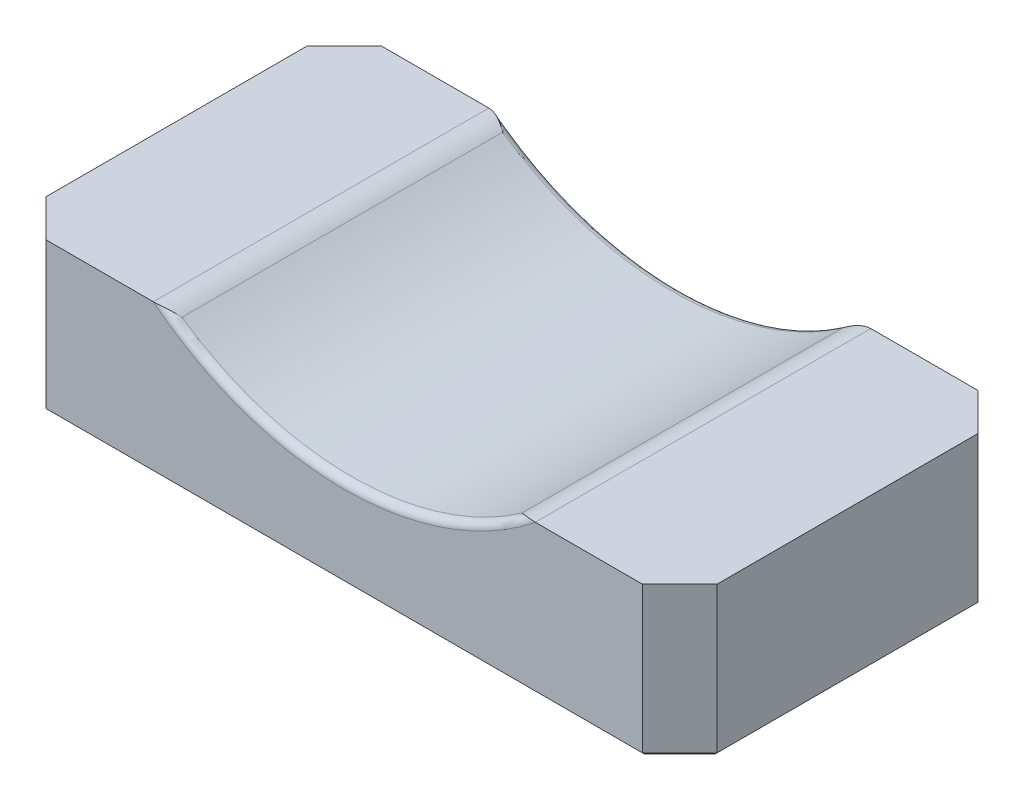
ISO-10303-21;
HEADER;
FILE_DESCRIPTION(('STEP AP214'),'2;1');
FILE_NAME('part.step','',(''),(''),'','','');
FILE_SCHEMA(('AUTOMOTIVE_DESIGN { 1 0 10303 214 1 1 1 1 }'));
ENDSEC;
DATA;
#1=APPLICATION_CONTEXT('core data for automotive mechanical design processes');
#2=APPLICATION_PROTOCOL_DEFINITION('international standard','automotive_design',2000,#1);
#3=PRODUCT_CONTEXT('',#1,'mechanical');
#4=PRODUCT('Part','Part','',(#3));
#5=PRODUCT_RELATED_PRODUCT_CATEGORY('part','',(#4));
#6=PRODUCT_DEFINITION_FORMATION('','',#4);
#7=PRODUCT_DEFINITION_CONTEXT('part definition',#1,'design');
#8=PRODUCT_DEFINITION('design','',#6,#7);
#9=PRODUCT_DEFINITION_SHAPE('','',#8);
#10=(LENGTH_UNIT() NAMED_UNIT(*) SI_UNIT(.MILLI.,.METRE.));
#11=(NAMED_UNIT(*) PLANE_ANGLE_UNIT() SI_UNIT($,.RADIAN.));
#12=(NAMED_UNIT(*) SI_UNIT($,.STERADIAN.) SOLID_ANGLE_UNIT());
#13=UNCERTAINTY_MEASURE_WITH_UNIT(LENGTH_MEASURE(1.E-05),#10,'distance_accuracy_value','');
#14=(GEOMETRIC_REPRESENTATION_CONTEXT(3) GLOBAL_UNCERTAINTY_ASSIGNED_CONTEXT((#13)) GLOBAL_UNIT_ASSIGNED_CONTEXT((#10,
#11,#12)) REPRESENTATION_CONTEXT('',''));
#15=CARTESIAN_POINT('',(0.,0.,0.));
#16=DIRECTION('',(0.,0.,1.));
#17=DIRECTION('',(1.,0.,0.));
#18=AXIS2_PLACEMENT_3D('',#15,#16,#17);
#19=CARTESIAN_POINT('',(-57.1500000000011,2.91433543964104E-13,28.575));
#20=DIRECTION('',(0.,-1.00000000000002,0.));
#21=DIRECTION('',(0.,0.,-1.));
#22=AXIS2_PLACEMENT_3D('',#19,#20,#21);
#23=PLANE('',#22);
#24=DIRECTION('',(-1.00000000000002,0.,0.));
#25=VECTOR('',#24,1.);
#26=CARTESIAN_POINT('',(-57.1500000000011,0.,-28.575));
#27=LINE('',#26,#25);
#28=CARTESIAN_POINT('',(50.800000000001,-3.12250225675825E-13,-28.575));
#29=VERTEX_POINT('',#28);
#30=CARTESIAN_POINT('',(32.5526542696603,-2.91433543964104E-13,-28.575));
#31=VERTEX_POINT('',#30);
#32=EDGE_CURVE('E323',#29,#31,#27,.T.);
#33=ORIENTED_EDGE('',*,*,#32,.T.);
#34=CARTESIAN_POINT('',(32.5526542696603,-2.91433543964104E-13,-28.575));
#35=CARTESIAN_POINT('',(32.548523685736,0.,-28.5749999965568));
#36=CARTESIAN_POINT('',(32.5443931318137,2.91433540491812E-13,-28.5749921223812));
#37=CARTESIAN_POINT('',(32.5361320839801,2.91433539836673E-13,-28.574960632565));
#38=CARTESIAN_POINT('',(32.5320015900688,0.,-28.5749370169245));
#39=CARTESIAN_POINT('',(32.5278711261594,-2.91433543964104E-13,-28.5749055305516));
#40=B_SPLINE_CURVE_WITH_KNOTS('',3,(#34,#35,#36,#37,#38,#39),.UNSPECIFIED.,.F.,.F.,(4,2,4),(0.,
0.0123916842829707,0.0247833685450492),.UNSPECIFIED.);
#41=CARTESIAN_POINT('',(32.5278711261594,-2.91433543964104E-13,-28.5749055305516));
#42=VERTEX_POINT('',#41);
#43=EDGE_CURVE('E230',#31,#42,#40,.T.);
#44=ORIENTED_EDGE('',*,*,#43,.T.);
#45=DIRECTION('',(0.,0.,1.));
#46=VECTOR('',#45,1.);
#47=CARTESIAN_POINT('',(32.5278711261594,0.,28.575));
#48=LINE('',#47,#46);
#49=CARTESIAN_POINT('',(32.5278711261594,0.,28.5749055305516));
#50=VERTEX_POINT('',#49);
#51=EDGE_CURVE('E183',#42,#50,#48,.T.);
#52=ORIENTED_EDGE('',*,*,#51,.T.);
#53=CARTESIAN_POINT('',(32.5278711261594,0.,28.5749055305516));
#54=CARTESIAN_POINT('',(32.5320015900688,1.94289026603761E-13,28.5749370169245));
#55=CARTESIAN_POINT('',(32.5361320839801,2.91433539987533E-13,28.574960632565));
#56=CARTESIAN_POINT('',(32.5443931318137,2.91433540315103E-13,28.5749921223812));
#57=CARTESIAN_POINT('',(32.548523685736,1.9428902693133E-13,28.5749999965568));
#58=CARTESIAN_POINT('',(32.5526542696603,0.,28.575));
#59=B_SPLINE_CURVE_WITH_KNOTS('',3,(#53,#54,#55,#56,#57,#58),.UNSPECIFIED.,.F.,.F.,(4,2,4),(0.,
0.0123916842620785,0.0247833685450492),.UNSPECIFIED.);
#60=CARTESIAN_POINT('',(32.5526542696603,0.,28.575));
#61=VERTEX_POINT('',#60);
#62=EDGE_CURVE('E223',#50,#61,#59,.T.);
#63=ORIENTED_EDGE('',*,*,#62,.T.);
#64=DIRECTION('',(-1.00000000000002,0.,0.));
#65=VECTOR('',#64,1.);
#66=CARTESIAN_POINT('',(-57.1500000000011,2.91433543964104E-13,28.575));
#67=LINE('',#66,#65);
#68=CARTESIAN_POINT('',(50.800000000001,0.,28.575));
#69=VERTEX_POINT('',#68);
#70=EDGE_CURVE('E196',#69,#61,#67,.T.);
#71=ORIENTED_EDGE('',*,*,#70,.F.);
#72=DIRECTION('',(0.707106781186554,0.,-0.707106781186549));
#73=VECTOR('',#72,1.);
#74=CARTESIAN_POINT('',(50.800000000001,0.,28.575));
#75=LINE('',#74,#73);
#76=CARTESIAN_POINT('',(57.1500000000011,0.,22.2249999999999));
#77=VERTEX_POINT('',#76);
#78=EDGE_CURVE('E216',#69,#77,#75,.T.);
#79=ORIENTED_EDGE('',*,*,#78,.T.);
#80=DIRECTION('',(0.,0.,-1.));
#81=VECTOR('',#80,1.);
#82=CARTESIAN_POINT('',(57.1500000000011,0.,28.575));
#83=LINE('',#82,#81);
#84=CARTESIAN_POINT('',(57.1500000000011,-2.91433543964104E-13,-22.225));
#85=VERTEX_POINT('',#84);
#86=EDGE_CURVE('E195',#77,#85,#83,.T.);
#87=ORIENTED_EDGE('',*,*,#86,.T.);
#88=DIRECTION('',(0.707106781186558,0.,0.707106781186545));
#89=VECTOR('',#88,1.);
#90=CARTESIAN_POINT('',(57.1500000000011,-2.91433543964104E-13,-22.225));
#91=LINE('',#90,#89);
#92=EDGE_CURVE('E218',#85,#29,#91,.F.);
#93=ORIENTED_EDGE('',*,*,#92,.T.);
#94=EDGE_LOOP('',(#33,#44,#52,#63,#71,#79,#87,#93));
#95=FACE_BOUND('',#94,.T.);
#96=ADVANCED_FACE('F46',(#95),#23,.F.);
#97=CARTESIAN_POINT('',(-57.1500000000011,2.91433543964104E-13,28.575));
#98=DIRECTION('',(1.00000000000002,0.,0.));
#99=DIRECTION('',(0.,0.,-1.));
#100=AXIS2_PLACEMENT_3D('',#97,#98,#99);
#101=PLANE('',#100);
#102=DIRECTION('',(0.,-1.00000000000002,0.));
#103=VECTOR('',#102,1.);
#104=CARTESIAN_POINT('',(-57.1500000000011,0.,-22.225));
#105=LINE('',#104,#103);
#106=CARTESIAN_POINT('',(-57.1500000000011,0.,-22.225));
#107=VERTEX_POINT('',#106);
#108=CARTESIAN_POINT('',(-57.150000000001,-24.8920000000002,-22.2250000000001));
#109=VERTEX_POINT('',#108);
#110=EDGE_CURVE('E182',#107,#109,#105,.T.);
#111=ORIENTED_EDGE('',*,*,#110,.T.);
#112=DIRECTION('',(0.,0.,1.));
#113=VECTOR('',#112,1.);
#114=CARTESIAN_POINT('',(-57.150000000001,-24.8920000000002,28.5749999999999));
#115=LINE('',#114,#113);
#116=CARTESIAN_POINT('',(-57.150000000001,-24.8920000000002,22.2249999999999));
#117=VERTEX_POINT('',#116);
#118=EDGE_CURVE('E13',#109,#117,#115,.T.);
#119=ORIENTED_EDGE('',*,*,#118,.T.);
#120=DIRECTION('',(0.,1.00000000000002,0.));
#121=VECTOR('',#120,1.);
#122=CARTESIAN_POINT('',(-57.1500000000011,2.91433543964104E-13,22.2249999999999));
#123=LINE('',#122,#121);
#124=CARTESIAN_POINT('',(-57.1500000000011,2.91433543964104E-13,22.2249999999999));
#125=VERTEX_POINT('',#124);
#126=EDGE_CURVE('E173',#117,#125,#123,.T.);
#127=ORIENTED_EDGE('',*,*,#126,.T.);
#128=DIRECTION('',(0.,0.,-1.));
#129=VECTOR('',#128,1.);
#130=CARTESIAN_POINT('',(-57.1500000000011,2.91433543964104E-13,28.575));
#131=LINE('',#130,#129);
#132=EDGE_CURVE('E176',#125,#107,#131,.T.);
#133=ORIENTED_EDGE('',*,*,#132,.T.);
#134=EDGE_LOOP('',(#111,#119,#127,#133));
#135=FACE_BOUND('',#134,.T.);
#136=ADVANCED_FACE('F175',(#135),#101,.F.);
#137=CARTESIAN_POINT('',(-57.150000000001,-25.4000000000002,28.5749999999999));
#138=DIRECTION('',(0.,1.00000000000002,0.));
#139=DIRECTION('',(-1.00000000000002,0.,0.));
#140=AXIS2_PLACEMENT_3D('',#137,#138,#139);
#141=PLANE('',#140);
#142=CARTESIAN_POINT('',(31.75,-25.4000000000002,0.));
#143=DIRECTION('',(0.,-1.,0.));
#144=DIRECTION('',(1.,0.,0.));
#145=AXIS2_PLACEMENT_3D('',#142,#143,#144);
#146=CIRCLE('',#145,7.112);
#147=CARTESIAN_POINT('',(38.862,-25.4000000000002,0.));
#148=VERTEX_POINT('',#147);
#149=EDGE_CURVE('E469',#148,#148,#146,.T.);
#150=ORIENTED_EDGE('',*,*,#149,.F.);
#151=EDGE_LOOP('',(#150));
#152=FACE_BOUND('',#151,.T.);
#153=CARTESIAN_POINT('',(-31.75,-25.4000000000002,0.));
#154=DIRECTION('',(0.,-1.,0.));
#155=DIRECTION('',(1.,0.,0.));
#156=AXIS2_PLACEMENT_3D('',#153,#154,#155);
#157=CIRCLE('',#156,7.112);
#158=CARTESIAN_POINT('',(-24.638,-25.4000000000002,0.));
#159=VERTEX_POINT('',#158);
#160=EDGE_CURVE('E472',#159,#159,#157,.T.);
#161=ORIENTED_EDGE('',*,*,#160,.F.);
#162=EDGE_LOOP('',(#161));
#163=FACE_BOUND('',#162,.T.);
#164=DIRECTION('',(-1.00000000000002,0.,0.));
#165=VECTOR('',#164,1.);
#166=CARTESIAN_POINT('',(-50.800000000001,-25.4000000000003,28.0669999999998));
#167=LINE('',#166,#165);
#168=CARTESIAN_POINT('',(50.5895795103156,-25.4000000000003,28.0669999999998));
#169=VERTEX_POINT('',#168);
#170=CARTESIAN_POINT('',(-50.5895795103154,-25.4000000000003,28.0669999999998));
#171=VERTEX_POINT('',#170);
#172=EDGE_CURVE('E404',#169,#171,#167,.T.);
#173=ORIENTED_EDGE('',*,*,#172,.T.);
#174=DIRECTION('',(-0.707106781186554,0.,-0.707106781186549));
#175=VECTOR('',#174,1.);
#176=CARTESIAN_POINT('',(-56.7907897551582,-25.4000000000002,21.865789755157));
#177=LINE('',#176,#175);
#178=CARTESIAN_POINT('',(-56.642000000001,-25.4000000000002,22.0145795103143));
#179=VERTEX_POINT('',#178);
#180=EDGE_CURVE('E401',#171,#179,#177,.T.);
#181=ORIENTED_EDGE('',*,*,#180,.T.);
#182=DIRECTION('',(0.,0.,-1.));
#183=VECTOR('',#182,1.);
#184=CARTESIAN_POINT('',(-56.642000000001,-25.4000000000002,28.5749999999999));
#185=LINE('',#184,#183);
#186=CARTESIAN_POINT('',(-56.642000000001,-25.4000000000002,-22.0145795103146));
#187=VERTEX_POINT('',#186);
#188=EDGE_CURVE('E412',#179,#187,#185,.T.);
#189=ORIENTED_EDGE('',*,*,#188,.T.);
#190=DIRECTION('',(0.707106781186558,0.,-0.707106781186545));
#191=VECTOR('',#190,1.);
#192=CARTESIAN_POINT('',(-50.4407897551582,-25.4000000000003,-28.2157897551574));
#193=LINE('',#192,#191);
#194=CARTESIAN_POINT('',(-50.5895795103154,-25.4000000000003,-28.0670000000001));
#195=VERTEX_POINT('',#194);
#196=EDGE_CURVE('E411',#187,#195,#193,.T.);
#197=ORIENTED_EDGE('',*,*,#196,.T.);
#198=DIRECTION('',(1.00000000000002,0.,0.));
#199=VECTOR('',#198,1.);
#200=CARTESIAN_POINT('',(-57.150000000001,-25.4000000000002,-28.0670000000001));
#201=LINE('',#200,#199);
#202=CARTESIAN_POINT('',(50.5895795103156,-25.4000000000004,-28.0670000000001));
#203=VERTEX_POINT('',#202);
#204=EDGE_CURVE('E409',#195,#203,#201,.T.);
#205=ORIENTED_EDGE('',*,*,#204,.T.);
#206=DIRECTION('',(0.707106781186558,0.,0.707106781186545));
#207=VECTOR('',#206,1.);
#208=CARTESIAN_POINT('',(56.7907897551584,-25.4000000000005,-21.8657897551574));
#209=LINE('',#208,#207);
#210=CARTESIAN_POINT('',(56.6420000000011,-25.4000000000005,-22.0145795103146));
#211=VERTEX_POINT('',#210);
#212=EDGE_CURVE('E354',#203,#211,#209,.T.);
#213=ORIENTED_EDGE('',*,*,#212,.T.);
#214=DIRECTION('',(0.,0.,1.));
#215=VECTOR('',#214,1.);
#216=CARTESIAN_POINT('',(56.6420000000011,-25.4000000000005,28.5749999999999));
#217=LINE('',#216,#215);
#218=CARTESIAN_POINT('',(56.6420000000011,-25.4000000000005,22.0145795103143));
#219=VERTEX_POINT('',#218);
#220=EDGE_CURVE('E393',#211,#219,#217,.T.);
#221=ORIENTED_EDGE('',*,*,#220,.T.);
#222=DIRECTION('',(-0.707106781186554,0.,0.707106781186549));
#223=VECTOR('',#222,1.);
#224=CARTESIAN_POINT('',(50.4407897551583,-25.4000000000003,28.2157897551571));
#225=LINE('',#224,#223);
#226=EDGE_CURVE('E388',#219,#169,#225,.T.);
#227=ORIENTED_EDGE('',*,*,#226,.T.);
#228=EDGE_LOOP('',(#173,#181,#189,#197,#205,#213,#221,#227));
#229=FACE_BOUND('',#228,.T.);
#230=ADVANCED_FACE('F320',(#152,#163,#229),#141,.F.);
#231=CARTESIAN_POINT('',(57.1500000000011,0.,28.575));
#232=DIRECTION('',(-1.00000000000002,0.,0.));
#233=DIRECTION('',(0.,0.,1.));
#234=AXIS2_PLACEMENT_3D('',#231,#232,#233);
#235=PLANE('',#234);
#236=DIRECTION('',(0.,-1.00000000000002,0.));
#237=VECTOR('',#236,1.);
#238=CARTESIAN_POINT('',(57.1500000000011,-25.4000000000005,22.2249999999998));
#239=LINE('',#238,#237);
#240=CARTESIAN_POINT('',(57.1500000000011,-24.8920000000005,22.2249999999998));
#241=VERTEX_POINT('',#240);
#242=EDGE_CURVE('E211',#77,#241,#239,.T.);
#243=ORIENTED_EDGE('',*,*,#242,.T.);
#244=DIRECTION('',(0.,0.,-1.));
#245=VECTOR('',#244,1.);
#246=CARTESIAN_POINT('',(57.1500000000011,-24.8920000000005,28.5749999999999));
#247=LINE('',#246,#245);
#248=CARTESIAN_POINT('',(57.1500000000011,-24.8920000000005,-22.2250000000001));
#249=VERTEX_POINT('',#248);
#250=EDGE_CURVE('E364',#241,#249,#247,.T.);
#251=ORIENTED_EDGE('',*,*,#250,.T.);
#252=DIRECTION('',(0.,1.00000000000002,0.));
#253=VECTOR('',#252,1.);
#254=CARTESIAN_POINT('',(57.1500000000011,-2.91433543964104E-13,-22.225));
#255=LINE('',#254,#253);
#256=EDGE_CURVE('E214',#249,#85,#255,.T.);
#257=ORIENTED_EDGE('',*,*,#256,.T.);
#258=ORIENTED_EDGE('',*,*,#86,.F.);
#259=EDGE_LOOP('',(#243,#251,#257,#258));
#260=FACE_BOUND('',#259,.T.);
#261=ADVANCED_FACE('F244',(#260),#235,.F.);
#262=DIRECTION('',(0.,0.,1.));
#263=VECTOR('',#262,1.);
#264=CARTESIAN_POINT('',(-32.5278711261594,2.91433543964104E-13,28.575));
#265=LINE('',#264,#263);
#266=CARTESIAN_POINT('',(-32.5278711261594,2.91433543964104E-13,28.5749055305516));
#267=VERTEX_POINT('',#266);
#268=CARTESIAN_POINT('',(-32.5278711261594,0.,-28.5749055305516));
#269=VERTEX_POINT('',#268);
#270=EDGE_CURVE('E342',#267,#269,#265,.F.);
#271=ORIENTED_EDGE('',*,*,#270,.T.);
#272=CARTESIAN_POINT('',(-32.5278711261594,0.,-28.5749055305516));
#273=CARTESIAN_POINT('',(-32.5320015900688,1.94289026612377E-13,-28.5749370169245));
#274=CARTESIAN_POINT('',(-32.5361320839801,2.91433540000458E-13,-28.574960632565));
#275=CARTESIAN_POINT('',(-32.5443931318137,2.91433540328027E-13,-28.5749921223812));
#276=CARTESIAN_POINT('',(-32.548523685736,1.94289026939946E-13,-28.5749999965568));
#277=CARTESIAN_POINT('',(-32.5526542696603,0.,-28.575));
#278=B_SPLINE_CURVE_WITH_KNOTS('',3,(#272,#273,#274,#275,#276,#277),.UNSPECIFIED.,.F.,.F.,(4,2,
4),(0.,0.0123916842620785,0.0247833685450492),.UNSPECIFIED.);
#279=CARTESIAN_POINT('',(-32.5526542696603,0.,-28.575));
#280=VERTEX_POINT('',#279);
#281=EDGE_CURVE('E258',#269,#280,#278,.T.);
#282=ORIENTED_EDGE('',*,*,#281,.T.);
#283=CARTESIAN_POINT('',(-50.800000000001,0.,-28.575));
#284=VERTEX_POINT('',#283);
#285=EDGE_CURVE('E330',#280,#284,#27,.T.);
#286=ORIENTED_EDGE('',*,*,#285,.T.);
#287=DIRECTION('',(0.707106781186558,0.,-0.707106781186545));
#288=VECTOR('',#287,1.);
#289=CARTESIAN_POINT('',(-57.1500000000011,0.,-22.225));
#290=LINE('',#289,#288);
#291=EDGE_CURVE('E194',#284,#107,#290,.F.);
#292=ORIENTED_EDGE('',*,*,#291,.T.);
#293=ORIENTED_EDGE('',*,*,#132,.F.);
#294=DIRECTION('',(0.707106781186554,0.,0.707106781186549));
#295=VECTOR('',#294,1.);
#296=CARTESIAN_POINT('',(-50.800000000001,3.12250225675825E-13,28.575));
#297=LINE('',#296,#295);
#298=CARTESIAN_POINT('',(-50.800000000001,3.12250225675825E-13,28.575));
#299=VERTEX_POINT('',#298);
#300=EDGE_CURVE('E190',#125,#299,#297,.T.);
#301=ORIENTED_EDGE('',*,*,#300,.T.);
#302=CARTESIAN_POINT('',(-32.5526542696603,2.91433543964104E-13,28.575));
#303=VERTEX_POINT('',#302);
#304=EDGE_CURVE('E329',#303,#299,#67,.T.);
#305=ORIENTED_EDGE('',*,*,#304,.F.);
#306=CARTESIAN_POINT('',(-32.5526542696603,2.91433543964104E-13,28.575));
#307=CARTESIAN_POINT('',(-32.548523685736,2.91433541439479E-13,28.5749999965568));
#308=CARTESIAN_POINT('',(-32.5443931318137,2.91433540177167E-13,28.5749921223812));
#309=CARTESIAN_POINT('',(-32.5361320839801,2.91433540177167E-13,28.574960632565));
#310=CARTESIAN_POINT('',(-32.5320015900688,2.91433541439479E-13,28.5749370169245));
#311=CARTESIAN_POINT('',(-32.5278711261594,2.91433543964104E-13,28.5749055305516));
#312=B_SPLINE_CURVE_WITH_KNOTS('',3,(#306,#307,#308,#309,#310,#311),.UNSPECIFIED.,.F.,.F.,(4,2,
4),(0.,0.0123916842829707,0.0247833685450492),.UNSPECIFIED.);
#313=EDGE_CURVE('E253',#303,#267,#312,.T.);
#314=ORIENTED_EDGE('',*,*,#313,.T.);
#315=EDGE_LOOP('',(#271,#282,#286,#292,#293,#301,#305,#314));
#316=FACE_BOUND('',#315,.T.);
#317=ADVANCED_FACE('F188',(#316),#23,.F.);
#318=CARTESIAN_POINT('',(-57.1500000000011,2.91433543964104E-13,28.575));
#319=DIRECTION('',(0.,0.,1.));
#320=DIRECTION('',(1.00000000000002,0.,0.));
#321=AXIS2_PLACEMENT_3D('',#318,#319,#320);
#322=PLANE('',#321);
#323=DIRECTION('',(0.,-1.00000000000002,0.));
#324=VECTOR('',#323,1.);
#325=CARTESIAN_POINT('',(-50.800000000001,-25.4000000000003,28.5749999999999));
#326=LINE('',#325,#324);
#327=CARTESIAN_POINT('',(-50.800000000001,-24.8920000000003,28.5749999999999));
#328=VERTEX_POINT('',#327);
#329=EDGE_CURVE('E200',#299,#328,#326,.T.);
#330=ORIENTED_EDGE('',*,*,#329,.T.);
#331=DIRECTION('',(1.00000000000002,0.,0.));
#332=VECTOR('',#331,1.);
#333=CARTESIAN_POINT('',(50.8000000000011,-24.8920000000002,28.5749999999999));
#334=LINE('',#333,#332);
#335=CARTESIAN_POINT('',(50.8000000000011,-24.8920000000002,28.5749999999999));
#336=VERTEX_POINT('',#335);
#337=EDGE_CURVE('E395',#328,#336,#334,.T.);
#338=ORIENTED_EDGE('',*,*,#337,.T.);
#339=DIRECTION('',(0.,1.00000000000002,0.));
#340=VECTOR('',#339,1.);
#341=CARTESIAN_POINT('',(50.800000000001,0.,28.575));
#342=LINE('',#341,#340);
#343=EDGE_CURVE('E203',#336,#69,#342,.T.);
#344=ORIENTED_EDGE('',*,*,#343,.T.);
#345=ORIENTED_EDGE('',*,*,#70,.T.);
#346=CARTESIAN_POINT('',(0.,40.6400000000007,28.575));
#347=DIRECTION('',(0.,0.,1.));
#348=DIRECTION('',(1.00000000000002,0.,0.));
#349=AXIS2_PLACEMENT_3D('',#346,#347,#348);
#350=CIRCLE('',#349,52.07);
#351=EDGE_CURVE('E269',#61,#303,#350,.F.);
#352=ORIENTED_EDGE('',*,*,#351,.T.);
#353=ORIENTED_EDGE('',*,*,#304,.T.);
#354=EDGE_LOOP('',(#330,#338,#344,#345,#352,#353));
#355=FACE_BOUND('',#354,.T.);
#356=ADVANCED_FACE('F243',(#355),#322,.T.);
#357=CARTESIAN_POINT('',(-57.1500000000011,0.,-28.575));
#358=DIRECTION('',(0.,0.,1.));
#359=DIRECTION('',(1.00000000000002,0.,0.));
#360=AXIS2_PLACEMENT_3D('',#357,#358,#359);
#361=PLANE('',#360);
#362=DIRECTION('',(0.,-1.00000000000002,0.));
#363=VECTOR('',#362,1.);
#364=CARTESIAN_POINT('',(50.800000000001,-3.12250225675825E-13,-28.575));
#365=LINE('',#364,#363);
#366=CARTESIAN_POINT('',(50.8000000000011,-24.8920000000004,-28.5750000000001));
#367=VERTEX_POINT('',#366);
#368=EDGE_CURVE('E205',#29,#367,#365,.T.);
#369=ORIENTED_EDGE('',*,*,#368,.T.);
#370=DIRECTION('',(-1.00000000000002,0.,0.));
#371=VECTOR('',#370,1.);
#372=CARTESIAN_POINT('',(-57.150000000001,-24.8920000000002,-28.5750000000001));
#373=LINE('',#372,#371);
#374=CARTESIAN_POINT('',(-50.800000000001,-24.8920000000003,-28.5750000000001));
#375=VERTEX_POINT('',#374);
#376=EDGE_CURVE('E70',#367,#375,#373,.T.);
#377=ORIENTED_EDGE('',*,*,#376,.T.);
#378=DIRECTION('',(0.,1.00000000000002,0.));
#379=VECTOR('',#378,1.);
#380=CARTESIAN_POINT('',(-50.800000000001,0.,-28.575));
#381=LINE('',#380,#379);
#382=EDGE_CURVE('E201',#375,#284,#381,.T.);
#383=ORIENTED_EDGE('',*,*,#382,.T.);
#384=ORIENTED_EDGE('',*,*,#285,.F.);
#385=CARTESIAN_POINT('',(0.,40.6400000000006,-28.575));
#386=DIRECTION('',(0.,0.,1.));
#387=DIRECTION('',(1.00000000000002,0.,0.));
#388=AXIS2_PLACEMENT_3D('',#385,#386,#387);
#389=CIRCLE('',#388,52.07);
#390=EDGE_CURVE('E220',#280,#31,#389,.T.);
#391=ORIENTED_EDGE('',*,*,#390,.T.);
#392=ORIENTED_EDGE('',*,*,#32,.F.);
#393=EDGE_LOOP('',(#369,#377,#383,#384,#391,#392));
#394=FACE_BOUND('',#393,.T.);
#395=ADVANCED_FACE('F245',(#394),#361,.F.);
#396=CARTESIAN_POINT('',(0.,40.6400000000006,-28.575));
#397=DIRECTION('',(0.,0.,1.));
#398=DIRECTION('',(1.00000000000002,0.,0.));
#399=AXIS2_PLACEMENT_3D('',#396,#397,#398);
#400=CYLINDRICAL_SURFACE('',#399,50.8);
#401=DIRECTION('',(0.,0.,1.));
#402=VECTOR('',#401,1.);
#403=CARTESIAN_POINT('',(28.9136632232529,-1.12888888888918,-28.575));
#404=LINE('',#403,#402);
#405=CARTESIAN_POINT('',(28.9136632232529,-1.12888888888889,27.305));
#406=VERTEX_POINT('',#405);
#407=CARTESIAN_POINT('',(28.9136632232529,-1.12888888888915,-27.305));
#408=VERTEX_POINT('',#407);
#409=EDGE_CURVE('E336',#406,#408,#404,.F.);
#410=ORIENTED_EDGE('',*,*,#409,.T.);
#411=CARTESIAN_POINT('',(0.,40.6400000000006,-27.305));
#412=DIRECTION('',(0.,0.,1.));
#413=DIRECTION('',(1.00000000000002,0.,0.));
#414=AXIS2_PLACEMENT_3D('',#411,#412,#413);
#415=CIRCLE('',#414,50.8);
#416=CARTESIAN_POINT('',(-28.9136632232529,-1.12888888888892,-27.305));
#417=VERTEX_POINT('',#416);
#418=EDGE_CURVE('E430',#408,#417,#415,.F.);
#419=ORIENTED_EDGE('',*,*,#418,.T.);
#420=DIRECTION('',(0.,0.,1.));
#421=VECTOR('',#420,1.);
#422=CARTESIAN_POINT('',(-28.9136632232529,-1.12888888888892,-28.575));
#423=LINE('',#422,#421);
#424=CARTESIAN_POINT('',(-28.9136632232529,-1.12888888888864,27.305));
#425=VERTEX_POINT('',#424);
#426=EDGE_CURVE('E339',#417,#425,#423,.T.);
#427=ORIENTED_EDGE('',*,*,#426,.T.);
#428=CARTESIAN_POINT('',(0.,40.6400000000007,27.305));
#429=DIRECTION('',(0.,0.,1.));
#430=DIRECTION('',(1.00000000000002,0.,0.));
#431=AXIS2_PLACEMENT_3D('',#428,#429,#430);
#432=CIRCLE('',#431,50.8);
#433=EDGE_CURVE('E288',#425,#406,#432,.T.);
#434=ORIENTED_EDGE('',*,*,#433,.T.);
#435=EDGE_LOOP('',(#410,#419,#427,#434));
#436=FACE_BOUND('',#435,.T.);
#437=ADVANCED_FACE('F437',(#436),#400,.F.);
#438=CARTESIAN_POINT('',(-32.5278711261594,-6.35000000000004,-28.5750000000001));
#439=DIRECTION('',(0.,0.,1.));
#440=DIRECTION('',(1.00000000000002,0.,0.));
#441=AXIS2_PLACEMENT_3D('',#438,#439,#440);
#442=CYLINDRICAL_SURFACE('',#441,6.35);
#443=ORIENTED_EDGE('',*,*,#426,.F.);
#444=CARTESIAN_POINT('',(-32.5278711261594,0.,-28.5749055305516));
#445=CARTESIAN_POINT('',(-32.4326052727065,1.23361700358794E-05,-28.5741375717471));
#446=CARTESIAN_POINT('',(-32.3374751653546,-0.00214318057374986,-28.5692935018116));
#447=CARTESIAN_POINT('',(-32.1481863465688,-0.010658225621164,-28.5526880681244));
#448=CARTESIAN_POINT('',(-32.05402607832,-0.0170093761233202,-28.5409404943753));
#449=CARTESIAN_POINT('',(-31.867685648764,-0.0337228581218755,-28.5118582370422));
#450=CARTESIAN_POINT('',(-31.7754959899061,-0.0440551522599837,-28.494565550953));
#451=CARTESIAN_POINT('',(-31.592595040929,-0.0685768401766249,-28.4552816794636));
#452=CARTESIAN_POINT('',(-31.5018847960354,-0.0827688455498842,-28.4332873149329));
#453=CARTESIAN_POINT('',(-31.2608537419123,-0.1257936947056,-28.369059066685));
#454=CARTESIAN_POINT('',(-31.1120787258601,-0.158009908817166,-28.3232532601377));
#455=CARTESIAN_POINT('',(-30.8197732187223,-0.232184675674215,-28.2235452546097));
#456=CARTESIAN_POINT('',(-30.6762452470046,-0.274147839116602,-28.1696392281752));
#457=CARTESIAN_POINT('',(-30.3940195381641,-0.367412389415487,-28.0557135437908));
#458=CARTESIAN_POINT('',(-30.2553445790987,-0.418752195886097,-27.9956691977282));
#459=CARTESIAN_POINT('',(-29.9835493734577,-0.53016391967048,-27.8714593233469));
#460=CARTESIAN_POINT('',(-29.8504272272185,-0.590232818626511,-27.8072952238256));
#461=CARTESIAN_POINT('',(-29.5811370801932,-0.722989158594967,-27.6720050165354));
#462=CARTESIAN_POINT('',(-29.4453414065977,-0.796245635373238,-27.600698247917));
#463=CARTESIAN_POINT('',(-29.1802544079629,-0.951895303067302,-27.4567385806822));
#464=CARTESIAN_POINT('',(-29.0509507544523,-1.03427014416024,-27.3840886221064));
#465=CARTESIAN_POINT('',(-28.9211076224025,-1.12374154264016,-27.3092930985073));
#466=CARTESIAN_POINT('',(-28.9173840306975,-1.12631324014462,-27.3071465392448));
#467=CARTESIAN_POINT('',(-28.9136632232529,-1.12888888888891,-27.305));
#468=B_SPLINE_CURVE_WITH_KNOTS('',3,(#444,#445,#446,#447,#448,#449,#450,#451,#452,#453,#454,
#455,#456,#457,#458,#459,#460,#461,#462,#463,#464,#465,#466,#467),.UNSPECIFIED.,.F.,.F.,(4,2,2,
2,2,2,2,2,2,2,2,4),(0.,0.285546239702894,0.570524019894234,0.853392490385611,1.1364528362895,
1.61259867700446,2.08897021411319,2.56733929413345,3.04554335489289,3.55509314032492,
4.06363553426623,4.07866144483396),.UNSPECIFIED.);
#469=EDGE_CURVE('E259',#417,#269,#468,.F.);
#470=ORIENTED_EDGE('',*,*,#469,.T.);
#471=ORIENTED_EDGE('',*,*,#270,.F.);
#472=CARTESIAN_POINT('',(-32.5278711261594,2.91433543964104E-13,28.5749055305516));
#473=CARTESIAN_POINT('',(-32.4326052727065,1.23361701199683E-05,28.5741375717471));
#474=CARTESIAN_POINT('',(-32.3374751653546,-0.0021431805737323,28.5692935018116));
#475=CARTESIAN_POINT('',(-32.1481863465689,-0.0106582256211819,28.5526880681244));
#476=CARTESIAN_POINT('',(-32.0540260783201,-0.0170093761233074,28.5409404943753));
#477=CARTESIAN_POINT('',(-31.867685648764,-0.0337228581218869,28.5118582370423));
#478=CARTESIAN_POINT('',(-31.7754959899061,-0.0440551522600492,28.494565550953));
#479=CARTESIAN_POINT('',(-31.592595040929,-0.0685768401765563,28.4552816794636));
#480=CARTESIAN_POINT('',(-31.5018847960354,-0.0827688455496268,28.4332873149329));
#481=CARTESIAN_POINT('',(-31.2608537419123,-0.125793694705196,28.369059066685));
#482=CARTESIAN_POINT('',(-31.1120787258602,-0.15800990881705,28.3232532601378));
#483=CARTESIAN_POINT('',(-30.8197732187224,-0.232184675674295,28.2235452546098));
#484=CARTESIAN_POINT('',(-30.6762452470047,-0.274147839116589,28.1696392281753));
#485=CARTESIAN_POINT('',(-30.3940195381641,-0.367412389415461,28.055713543791));
#486=CARTESIAN_POINT('',(-30.2553445790987,-0.418752195886152,27.9956691977284));
#487=CARTESIAN_POINT('',(-29.9835493734578,-0.530163919670393,27.871459323347));
#488=CARTESIAN_POINT('',(-29.8504272272185,-0.5902328186262,27.8072952238256));
#489=CARTESIAN_POINT('',(-29.5811370801932,-0.722989158594713,27.6720050165355));
#490=CARTESIAN_POINT('',(-29.4453414065977,-0.7962456353733,27.6006982479175));
#491=CARTESIAN_POINT('',(-29.1802544079628,-0.951895303067299,27.4567385806826));
#492=CARTESIAN_POINT('',(-29.0509507544522,-1.03427014415985,27.3840886221064));
#493=CARTESIAN_POINT('',(-28.9211076224025,-1.12374154263988,27.3092930985073));
#494=CARTESIAN_POINT('',(-28.9173840306975,-1.12631324014434,27.3071465392448));
#495=CARTESIAN_POINT('',(-28.9136632232529,-1.12888888888864,27.305));
#496=B_SPLINE_CURVE_WITH_KNOTS('',3,(#472,#473,#474,#475,#476,#477,#478,#479,#480,#481,#482,
#483,#484,#485,#486,#487,#488,#489,#490,#491,#492,#493,#494,#495),.UNSPECIFIED.,.F.,.F.,(4,2,2,
2,2,2,2,2,2,2,2,4),(0.,0.285546239702886,0.570524019894232,0.853392490385607,1.13645283628947,
1.61259867700439,2.08897021411312,2.56733929413339,3.04554335489281,3.55509314032486,
4.06363553426615,4.07866144483388),.UNSPECIFIED.);
#497=EDGE_CURVE('E426',#267,#425,#496,.T.);
#498=ORIENTED_EDGE('',*,*,#497,.T.);
#499=EDGE_LOOP('',(#443,#470,#471,#498));
#500=FACE_BOUND('',#499,.T.);
#501=ADVANCED_FACE('F299',(#500),#442,.T.);
#502=CARTESIAN_POINT('',(32.5278711261594,-6.3500000000003,-28.5750000000001));
#503=DIRECTION('',(0.,0.,1.));
#504=DIRECTION('',(1.00000000000002,0.,0.));
#505=AXIS2_PLACEMENT_3D('',#502,#503,#504);
#506=CYLINDRICAL_SURFACE('',#505,6.35);
#507=ORIENTED_EDGE('',*,*,#51,.F.);
#508=CARTESIAN_POINT('',(32.5278711261594,-2.91433543964104E-13,-28.5749055305516));
#509=CARTESIAN_POINT('',(32.4326052727065,1.23361697618115E-05,-28.5741375717471));
#510=CARTESIAN_POINT('',(32.3374751653546,-0.00214318057401681,-28.5692935018116));
#511=CARTESIAN_POINT('',(32.1481863465688,-0.0106582256214265,-28.5526880681245));
#512=CARTESIAN_POINT('',(32.05402607832,-0.0170093761235851,-28.5409404943753));
#513=CARTESIAN_POINT('',(31.867685648764,-0.0337228581221439,-28.5118582370423));
#514=CARTESIAN_POINT('',(31.7754959899061,-0.0440551522602531,-28.4945655509531));
#515=CARTESIAN_POINT('',(31.592595040929,-0.0685768401768891,-28.4552816794637));
#516=CARTESIAN_POINT('',(31.5018847960354,-0.0827688455501421,-28.4332873149329));
#517=CARTESIAN_POINT('',(31.2608537419122,-0.125793694705856,-28.369059066685));
#518=CARTESIAN_POINT('',(31.1120787258601,-0.158009908817437,-28.3232532601379));
#519=CARTESIAN_POINT('',(30.8197732187223,-0.232184675674495,-28.2235452546099));
#520=CARTESIAN_POINT('',(30.6762452470045,-0.274147839116875,-28.1696392281753));
#521=CARTESIAN_POINT('',(30.394019538164,-0.367412389415785,-28.0557135437911));
#522=CARTESIAN_POINT('',(30.2553445790985,-0.418752195886426,-27.9956691977286));
#523=CARTESIAN_POINT('',(29.9835493734577,-0.530163919670765,-27.8714593233471));
#524=CARTESIAN_POINT('',(29.8504272272185,-0.590232818626721,-27.8072952238254));
#525=CARTESIAN_POINT('',(29.5811370801931,-0.722989158595298,-27.6720050165356));
#526=CARTESIAN_POINT('',(29.4453414065974,-0.796245635373782,-27.600698247918));
#527=CARTESIAN_POINT('',(29.1802544079625,-0.951895303067745,-27.4567385806832));
#528=CARTESIAN_POINT('',(29.0509507544522,-1.03427014416037,-27.3840886221064));
#529=CARTESIAN_POINT('',(28.9211076224025,-1.12374154264039,-27.3092930985073));
#530=CARTESIAN_POINT('',(28.9173840306975,-1.12631324014486,-27.3071465392448));
#531=CARTESIAN_POINT('',(28.9136632232529,-1.12888888888915,-27.305));
#532=B_SPLINE_CURVE_WITH_KNOTS('',3,(#508,#509,#510,#511,#512,#513,#514,#515,#516,#517,#518,
#519,#520,#521,#522,#523,#524,#525,#526,#527,#528,#529,#530,#531),.UNSPECIFIED.,.F.,.F.,(4,2,2,
2,2,2,2,2,2,2,2,4),(0.,0.285546239702913,0.570524019894257,0.853392490385629,1.13645283628951,
1.61259867700448,2.08897021411319,2.56733929413345,3.04554335489293,3.55509314032497,
4.06363553426626,4.078661444834),.UNSPECIFIED.);
#533=EDGE_CURVE('E282',#42,#408,#532,.T.);
#534=ORIENTED_EDGE('',*,*,#533,.T.);
#535=ORIENTED_EDGE('',*,*,#409,.F.);
#536=CARTESIAN_POINT('',(32.5278711261594,0.,28.5749055305516));
#537=CARTESIAN_POINT('',(32.4326052727065,1.23361698464971E-05,28.5741375717471));
#538=CARTESIAN_POINT('',(32.3374751653546,-0.00214318057399851,28.5692935018116));
#539=CARTESIAN_POINT('',(32.1481863465688,-0.0106582256214435,28.5526880681245));
#540=CARTESIAN_POINT('',(32.05402607832,-0.0170093761235713,28.5409404943753));
#541=CARTESIAN_POINT('',(31.867685648764,-0.0337228581221536,28.5118582370423));
#542=CARTESIAN_POINT('',(31.7754959899061,-0.0440551522603163,28.4945655509531));
#543=CARTESIAN_POINT('',(31.592595040929,-0.0685768401768184,28.4552816794637));
#544=CARTESIAN_POINT('',(31.5018847960354,-0.0827688455498835,28.4332873149329));
#545=CARTESIAN_POINT('',(31.2608537419122,-0.125793694705454,28.369059066685));
#546=CARTESIAN_POINT('',(31.1120787258601,-0.158009908817324,28.3232532601379));
#547=CARTESIAN_POINT('',(30.8197732187223,-0.232184675674579,28.22354525461));
#548=CARTESIAN_POINT('',(30.6762452470046,-0.274147839116866,28.1696392281754));
#549=CARTESIAN_POINT('',(30.394019538164,-0.367412389415762,28.0557135437913));
#550=CARTESIAN_POINT('',(30.2553445790985,-0.418752195886485,27.9956691977288));
#551=CARTESIAN_POINT('',(29.9835493734577,-0.530163919670681,27.8714593233472));
#552=CARTESIAN_POINT('',(29.8504272272186,-0.590232818626412,27.8072952238254));
#553=CARTESIAN_POINT('',(29.5811370801931,-0.72298915859503,27.6720050165357));
#554=CARTESIAN_POINT('',(29.4453414065973,-0.796245635373814,27.6006982479185));
#555=CARTESIAN_POINT('',(29.1802544079624,-0.951895303067783,27.4567385806836));
#556=CARTESIAN_POINT('',(29.0509507544522,-1.03427014416011,27.3840886221064));
#557=CARTESIAN_POINT('',(28.9211076224025,-1.12374154264013,27.3092930985073));
#558=CARTESIAN_POINT('',(28.9173840306975,-1.12631324014459,27.3071465392448));
#559=CARTESIAN_POINT('',(28.9136632232529,-1.12888888888889,27.305));
#560=B_SPLINE_CURVE_WITH_KNOTS('',3,(#536,#537,#538,#539,#540,#541,#542,#543,#544,#545,#546,
#547,#548,#549,#550,#551,#552,#553,#554,#555,#556,#557,#558,#559),.UNSPECIFIED.,.F.,.F.,(4,2,2,
2,2,2,2,2,2,2,2,4),(0.,0.285546239702898,0.57052401989424,0.85339249038561,1.13645283628948,
1.61259867700442,2.08897021411314,2.56733929413341,3.04554335489285,3.5550931403249,
4.06363553426619,4.07866144483393),.UNSPECIFIED.);
#561=EDGE_CURVE('E289',#406,#50,#560,.F.);
#562=ORIENTED_EDGE('',*,*,#561,.T.);
#563=EDGE_LOOP('',(#507,#534,#535,#562));
#564=FACE_BOUND('',#563,.T.);
#565=ADVANCED_FACE('F294',(#564),#506,.T.);
#566=CARTESIAN_POINT('',(-57.1500000000011,0.,-22.225));
#567=DIRECTION('',(0.707106781186554,0.,0.70710678118655));
#568=DIRECTION('',(0.707106781186558,0.,-0.707106781186545));
#569=AXIS2_PLACEMENT_3D('',#566,#567,#568);
#570=PLANE('',#569);
#571=ORIENTED_EDGE('',*,*,#382,.F.);
#572=DIRECTION('',(0.707106781186558,0.,-0.707106781186545));
#573=VECTOR('',#572,1.);
#574=CARTESIAN_POINT('',(-57.150000000001,-24.8920000000002,-22.2250000000001));
#575=LINE('',#574,#573);
#576=EDGE_CURVE('E55',#375,#109,#575,.F.);
#577=ORIENTED_EDGE('',*,*,#576,.T.);
#578=ORIENTED_EDGE('',*,*,#110,.F.);
#579=ORIENTED_EDGE('',*,*,#291,.F.);
#580=EDGE_LOOP('',(#571,#577,#578,#579));
#581=FACE_BOUND('',#580,.T.);
#582=ADVANCED_FACE('F298',(#581),#570,.F.);
#583=CARTESIAN_POINT('',(-50.800000000001,3.12250225675825E-13,28.575));
#584=DIRECTION('',(-0.707106781186558,0.,0.707106781186546));
#585=DIRECTION('',(0.707106781186554,0.,0.707106781186549));
#586=AXIS2_PLACEMENT_3D('',#583,#584,#585);
#587=PLANE('',#586);
#588=ORIENTED_EDGE('',*,*,#126,.F.);
#589=DIRECTION('',(0.707106781186554,0.,0.707106781186549));
#590=VECTOR('',#589,1.);
#591=CARTESIAN_POINT('',(-50.800000000001,-24.8920000000003,28.5749999999999));
#592=LINE('',#591,#590);
#593=EDGE_CURVE('E399',#117,#328,#592,.T.);
#594=ORIENTED_EDGE('',*,*,#593,.T.);
#595=ORIENTED_EDGE('',*,*,#329,.F.);
#596=ORIENTED_EDGE('',*,*,#300,.F.);
#597=EDGE_LOOP('',(#588,#594,#595,#596));
#598=FACE_BOUND('',#597,.T.);
#599=ADVANCED_FACE('F198',(#598),#587,.T.);
#600=CARTESIAN_POINT('',(57.1500000000011,-2.91433543964104E-13,-22.225));
#601=DIRECTION('',(-0.707106781186554,0.,0.70710678118655));
#602=DIRECTION('',(0.707106781186558,0.,0.707106781186545));
#603=AXIS2_PLACEMENT_3D('',#600,#601,#602);
#604=PLANE('',#603);
#605=ORIENTED_EDGE('',*,*,#256,.F.);
#606=DIRECTION('',(0.707106781186558,0.,0.707106781186545));
#607=VECTOR('',#606,1.);
#608=CARTESIAN_POINT('',(50.8000000000011,-24.8920000000004,-28.5750000000002));
#609=LINE('',#608,#607);
#610=EDGE_CURVE('E352',#249,#367,#609,.F.);
#611=ORIENTED_EDGE('',*,*,#610,.T.);
#612=ORIENTED_EDGE('',*,*,#368,.F.);
#613=ORIENTED_EDGE('',*,*,#92,.F.);
#614=EDGE_LOOP('',(#605,#611,#612,#613));
#615=FACE_BOUND('',#614,.T.);
#616=ADVANCED_FACE('F307',(#615),#604,.F.);
#617=CARTESIAN_POINT('',(50.800000000001,0.,28.575));
#618=DIRECTION('',(0.707106781186558,0.,0.707106781186546));
#619=DIRECTION('',(0.707106781186554,0.,-0.707106781186549));
#620=AXIS2_PLACEMENT_3D('',#617,#618,#619);
#621=PLANE('',#620);
#622=ORIENTED_EDGE('',*,*,#343,.F.);
#623=DIRECTION('',(0.707106781186554,0.,-0.707106781186549));
#624=VECTOR('',#623,1.);
#625=CARTESIAN_POINT('',(57.1500000000011,-24.8920000000005,22.2249999999998));
#626=LINE('',#625,#624);
#627=EDGE_CURVE('E387',#336,#241,#626,.T.);
#628=ORIENTED_EDGE('',*,*,#627,.T.);
#629=ORIENTED_EDGE('',*,*,#242,.F.);
#630=ORIENTED_EDGE('',*,*,#78,.F.);
#631=EDGE_LOOP('',(#622,#628,#629,#630));
#632=FACE_BOUND('',#631,.T.);
#633=ADVANCED_FACE('F275',(#632),#621,.T.);
#634=CARTESIAN_POINT('',(0.,40.6400000000006,-27.305));
#635=DIRECTION('',(0.,0.,1.));
#636=DIRECTION('',(1.00000000000002,0.,0.));
#637=AXIS2_PLACEMENT_3D('',#634,#635,#636);
#638=TOROIDAL_SURFACE('',#637,52.07,1.27);
#639=ORIENTED_EDGE('',*,*,#469,.F.);
#640=ORIENTED_EDGE('',*,*,#418,.F.);
#641=ORIENTED_EDGE('',*,*,#533,.F.);
#642=ORIENTED_EDGE('',*,*,#43,.F.);
#643=ORIENTED_EDGE('',*,*,#390,.F.);
#644=ORIENTED_EDGE('',*,*,#281,.F.);
#645=EDGE_LOOP('',(#639,#640,#641,#642,#643,#644));
#646=FACE_BOUND('',#645,.T.);
#647=ADVANCED_FACE('F271',(#646),#638,.T.);
#648=CARTESIAN_POINT('',(0.,40.6400000000007,27.305));
#649=DIRECTION('',(0.,0.,1.));
#650=DIRECTION('',(1.00000000000002,0.,0.));
#651=AXIS2_PLACEMENT_3D('',#648,#649,#650);
#652=TOROIDAL_SURFACE('',#651,52.07,1.27);
#653=ORIENTED_EDGE('',*,*,#313,.F.);
#654=ORIENTED_EDGE('',*,*,#351,.F.);
#655=ORIENTED_EDGE('',*,*,#62,.F.);
#656=ORIENTED_EDGE('',*,*,#561,.F.);
#657=ORIENTED_EDGE('',*,*,#433,.F.);
#658=ORIENTED_EDGE('',*,*,#497,.F.);
#659=EDGE_LOOP('',(#653,#654,#655,#656,#657,#658));
#660=FACE_BOUND('',#659,.T.);
#661=ADVANCED_FACE('F236',(#660),#652,.T.);
#662=CARTESIAN_POINT('',(25.0407897551574,-25.4000000000003,-53.6157897551571));
#663=DIRECTION('',(-0.500000000000011,0.707106781186551,0.500000000000005));
#664=DIRECTION('',(0.,-0.577350269189641,0.816496580927721));
#665=AXIS2_PLACEMENT_3D('',#662,#663,#664);
#666=PLANE('',#665);
#667=DIRECTION('',(-0.28108463771481,-0.678598344545858,0.67859834454585));
#668=VECTOR('',#667,1.);
#669=CARTESIAN_POINT('',(42.0772290173302,-45.9506320078393,-7.51636799216159));
#670=LINE('',#669,#668);
#671=EDGE_CURVE('E350',#367,#203,#670,.T.);
#672=ORIENTED_EDGE('',*,*,#671,.F.);
#673=ORIENTED_EDGE('',*,*,#610,.F.);
#674=DIRECTION('',(-0.678598344545858,-0.678598344545858,0.281084637714808));
#675=VECTOR('',#674,1.);
#676=CARTESIAN_POINT('',(48.117505802742,-33.9244941972599,-18.4836184014392));
#677=LINE('',#676,#675);
#678=EDGE_CURVE('E50',#211,#249,#677,.F.);
#679=ORIENTED_EDGE('',*,*,#678,.F.);
#680=ORIENTED_EDGE('',*,*,#212,.F.);
#681=EDGE_LOOP('',(#672,#673,#679,#680));
#682=FACE_BOUND('',#681,.T.);
#683=ADVANCED_FACE('F48',(#682),#666,.F.);
#684=CARTESIAN_POINT('',(57.1500000000011,-24.8920000000005,28.5749999999999));
#685=DIRECTION('',(-0.707106781186556,0.707106781186556,0.));
#686=DIRECTION('',(-0.707106781186556,-0.707106781186556,0.));
#687=AXIS2_PLACEMENT_3D('',#684,#685,#686);
#688=PLANE('',#687);
#689=ORIENTED_EDGE('',*,*,#678,.T.);
#690=ORIENTED_EDGE('',*,*,#250,.F.);
#691=DIRECTION('',(0.678598344545861,0.678598344545861,0.281084637714792));
#692=VECTOR('',#691,1.);
#693=CARTESIAN_POINT('',(58.361221668425,-23.6807783315766,22.7267044421012));
#694=LINE('',#693,#692);
#695=EDGE_CURVE('E357',#219,#241,#694,.T.);
#696=ORIENTED_EDGE('',*,*,#695,.F.);
#697=ORIENTED_EDGE('',*,*,#220,.F.);
#698=EDGE_LOOP('',(#689,#690,#696,#697));
#699=FACE_BOUND('',#698,.T.);
#700=ADVANCED_FACE('F392',(#699),#688,.F.);
#701=CARTESIAN_POINT('',(-57.150000000001,-25.4000000000002,-28.0670000000001));
#702=DIRECTION('',(0.,0.707106781186556,0.707106781186547));
#703=DIRECTION('',(0.,-0.707106781186556,0.707106781186548));
#704=AXIS2_PLACEMENT_3D('',#701,#702,#703);
#705=PLANE('',#704);
#706=ORIENTED_EDGE('',*,*,#671,.T.);
#707=ORIENTED_EDGE('',*,*,#204,.F.);
#708=DIRECTION('',(0.281084637714803,-0.67859834454586,0.678598344545851));
#709=VECTOR('',#708,1.);
#710=CARTESIAN_POINT('',(-47.0586184014402,-33.9244941972596,-19.5425058027408));
#711=LINE('',#710,#709);
#712=EDGE_CURVE('E361',#375,#195,#711,.T.);
#713=ORIENTED_EDGE('',*,*,#712,.F.);
#714=ORIENTED_EDGE('',*,*,#376,.F.);
#715=EDGE_LOOP('',(#706,#707,#713,#714));
#716=FACE_BOUND('',#715,.T.);
#717=ADVANCED_FACE('F359',(#716),#705,.F.);
#718=CARTESIAN_POINT('',(-3.53421024484261,-25.4000000000003,82.1907897551571));
#719=DIRECTION('',(0.500000000000017,-0.707106781186545,0.500000000000007));
#720=DIRECTION('',(0.816496580927734,0.577350269189647,0.));
#721=AXIS2_PLACEMENT_3D('',#718,#719,#720);
#722=PLANE('',#721);
#723=ORIENTED_EDGE('',*,*,#695,.T.);
#724=ORIENTED_EDGE('',*,*,#627,.F.);
#725=DIRECTION('',(-0.281084637714798,-0.678598344545861,-0.678598344545853));
#726=VECTOR('',#725,1.);
#727=CARTESIAN_POINT('',(56.6371009567952,-10.7999917051654,42.6670082948349));
#728=LINE('',#727,#726);
#729=EDGE_CURVE('E376',#169,#336,#728,.F.);
#730=ORIENTED_EDGE('',*,*,#729,.F.);
#731=ORIENTED_EDGE('',*,*,#226,.F.);
#732=EDGE_LOOP('',(#723,#724,#730,#731));
#733=FACE_BOUND('',#732,.T.);
#734=ADVANCED_FACE('F385',(#733),#722,.T.);
#735=CARTESIAN_POINT('',(-82.190789755158,-25.4000000000005,3.5342102448426));
#736=DIRECTION('',(0.500000000000012,0.707106781186548,0.500000000000007));
#737=DIRECTION('',(0.,-0.577350269189644,0.816496580927719));
#738=AXIS2_PLACEMENT_3D('',#735,#736,#737);
#739=PLANE('',#738);
#740=ORIENTED_EDGE('',*,*,#712,.T.);
#741=ORIENTED_EDGE('',*,*,#196,.F.);
#742=DIRECTION('',(0.678598344545859,-0.678598344545859,0.281084637714801));
#743=VECTOR('',#742,1.);
#744=CARTESIAN_POINT('',(-46.9923630079782,-35.0496369920235,-18.0175689962417));
#745=LINE('',#744,#743);
#746=EDGE_CURVE('E373',#109,#187,#745,.T.);
#747=ORIENTED_EDGE('',*,*,#746,.F.);
#748=ORIENTED_EDGE('',*,*,#576,.F.);
#749=EDGE_LOOP('',(#740,#741,#747,#748));
#750=FACE_BOUND('',#749,.T.);
#751=ADVANCED_FACE('F445',(#750),#739,.F.);
#752=CARTESIAN_POINT('',(-57.150000000001,-24.8920000000002,28.5749999999999));
#753=DIRECTION('',(0.,-0.707106781186556,0.707106781186547));
#754=DIRECTION('',(0.,-0.707106781186556,-0.707106781186548));
#755=AXIS2_PLACEMENT_3D('',#752,#753,#754);
#756=PLANE('',#755);
#757=ORIENTED_EDGE('',*,*,#729,.T.);
#758=ORIENTED_EDGE('',*,*,#337,.F.);
#759=DIRECTION('',(0.281084637714826,-0.678598344545855,-0.678598344545847));
#760=VECTOR('',#759,1.);
#761=CARTESIAN_POINT('',(-51.3017044421023,-23.6807783315763,29.7862216684239));
#762=LINE('',#761,#760);
#763=EDGE_CURVE('E370',#171,#328,#762,.F.);
#764=ORIENTED_EDGE('',*,*,#763,.F.);
#765=ORIENTED_EDGE('',*,*,#172,.F.);
#766=EDGE_LOOP('',(#757,#758,#764,#765));
#767=FACE_BOUND('',#766,.T.);
#768=ADVANCED_FACE('F474',(#767),#756,.T.);
#769=CARTESIAN_POINT('',(-56.642000000001,-25.4000000000002,28.5749999999999));
#770=DIRECTION('',(0.707106781186556,0.707106781186556,0.));
#771=DIRECTION('',(-0.707106781186556,0.707106781186556,0.));
#772=AXIS2_PLACEMENT_3D('',#769,#770,#771);
#773=PLANE('',#772);
#774=ORIENTED_EDGE('',*,*,#746,.T.);
#775=ORIENTED_EDGE('',*,*,#188,.F.);
#776=DIRECTION('',(0.678598344545856,-0.678598344545856,-0.28108463771482));
#777=VECTOR('',#776,1.);
#778=CARTESIAN_POINT('',(-57.8933580237931,-24.1486419762081,22.5329089751534));
#779=LINE('',#778,#777);
#780=EDGE_CURVE('E368',#117,#179,#779,.T.);
#781=ORIENTED_EDGE('',*,*,#780,.F.);
#782=ORIENTED_EDGE('',*,*,#118,.F.);
#783=EDGE_LOOP('',(#774,#775,#781,#782));
#784=FACE_BOUND('',#783,.T.);
#785=ADVANCED_FACE('F448',(#784),#773,.F.);
#786=CARTESIAN_POINT('',(-53.6157897551582,-25.4000000000002,25.0407897551571));
#787=DIRECTION('',(-0.500000000000009,-0.707106781186556,0.499999999999999));
#788=DIRECTION('',(0.816496580927742,-0.577350269189635,0.));
#789=AXIS2_PLACEMENT_3D('',#786,#787,#788);
#790=PLANE('',#789);
#791=ORIENTED_EDGE('',*,*,#763,.T.);
#792=ORIENTED_EDGE('',*,*,#593,.F.);
#793=ORIENTED_EDGE('',*,*,#780,.T.);
#794=ORIENTED_EDGE('',*,*,#180,.F.);
#795=EDGE_LOOP('',(#791,#792,#793,#794));
#796=FACE_BOUND('',#795,.T.);
#797=ADVANCED_FACE('F451',(#796),#790,.T.);
#798=CARTESIAN_POINT('',(-31.75,-20.3200000000002,0.));
#799=DIRECTION('',(0.,-1.,0.));
#800=DIRECTION('',(1.,0.,0.));
#801=AXIS2_PLACEMENT_3D('',#798,#799,#800);
#802=CYLINDRICAL_SURFACE('',#801,7.112);
#803=CARTESIAN_POINT('',(-31.75,-20.3200000000002,0.));
#804=DIRECTION('',(0.,-1.,0.));
#805=DIRECTION('',(1.,0.,0.));
#806=AXIS2_PLACEMENT_3D('',#803,#804,#805);
#807=CIRCLE('',#806,7.112);
#808=CARTESIAN_POINT('',(-24.638,-20.3200000000002,0.));
#809=VERTEX_POINT('',#808);
#810=EDGE_CURVE('E371',#809,#809,#807,.T.);
#811=ORIENTED_EDGE('',*,*,#810,.F.);
#812=EDGE_LOOP('',(#811));
#813=FACE_BOUND('',#812,.T.);
#814=ORIENTED_EDGE('',*,*,#160,.T.);
#815=EDGE_LOOP('',(#814));
#816=FACE_BOUND('',#815,.T.);
#817=ADVANCED_FACE('F589',(#813,#816),#802,.F.);
#818=CARTESIAN_POINT('',(-31.75,-20.3200000000002,0.));
#819=DIRECTION('',(0.,-1.,0.));
#820=DIRECTION('',(1.,0.,0.));
#821=AXIS2_PLACEMENT_3D('',#818,#819,#820);
#822=PLANE('',#821);
#823=ORIENTED_EDGE('',*,*,#810,.T.);
#824=EDGE_LOOP('',(#823));
#825=FACE_BOUND('',#824,.T.);
#826=ADVANCED_FACE('F594',(#825),#822,.T.);
#827=CARTESIAN_POINT('',(31.75,-20.3200000000002,0.));
#828=DIRECTION('',(0.,-1.,0.));
#829=DIRECTION('',(1.,0.,0.));
#830=AXIS2_PLACEMENT_3D('',#827,#828,#829);
#831=CYLINDRICAL_SURFACE('',#830,7.112);
#832=CARTESIAN_POINT('',(31.75,-20.3200000000002,0.));
#833=DIRECTION('',(0.,-1.,0.));
#834=DIRECTION('',(1.,0.,0.));
#835=AXIS2_PLACEMENT_3D('',#832,#833,#834);
#836=CIRCLE('',#835,7.112);
#837=CARTESIAN_POINT('',(38.862,-20.3200000000002,0.));
#838=VERTEX_POINT('',#837);
#839=EDGE_CURVE('E630',#838,#838,#836,.T.);
#840=ORIENTED_EDGE('',*,*,#839,.F.);
#841=EDGE_LOOP('',(#840));
#842=FACE_BOUND('',#841,.T.);
#843=ORIENTED_EDGE('',*,*,#149,.T.);
#844=EDGE_LOOP('',(#843));
#845=FACE_BOUND('',#844,.T.);
#846=ADVANCED_FACE('F604',(#842,#845),#831,.F.);
#847=CARTESIAN_POINT('',(31.75,-20.3200000000002,0.));
#848=DIRECTION('',(0.,-1.,0.));
#849=DIRECTION('',(1.,0.,0.));
#850=AXIS2_PLACEMENT_3D('',#847,#848,#849);
#851=PLANE('',#850);
#852=ORIENTED_EDGE('',*,*,#839,.T.);
#853=EDGE_LOOP('',(#852));
#854=FACE_BOUND('',#853,.T.);
#855=ADVANCED_FACE('F614',(#854),#851,.T.);
#856=CLOSED_SHELL('',(#96,#136,#230,#261,#317,#356,#395,#437,#501,#565,#582,#599,#616,#633,#647,
#661,#683,#700,#717,#734,#751,#768,#785,#797,#817,#826,#846,#855));
#857=MANIFOLD_SOLID_BREP('B2',#856);
#858=ADVANCED_BREP_SHAPE_REPRESENTATION('',(#18,#857),#14);
#859=SHAPE_DEFINITION_REPRESENTATION(#9,#858);
ENDSEC;
END-ISO-10303-21;
